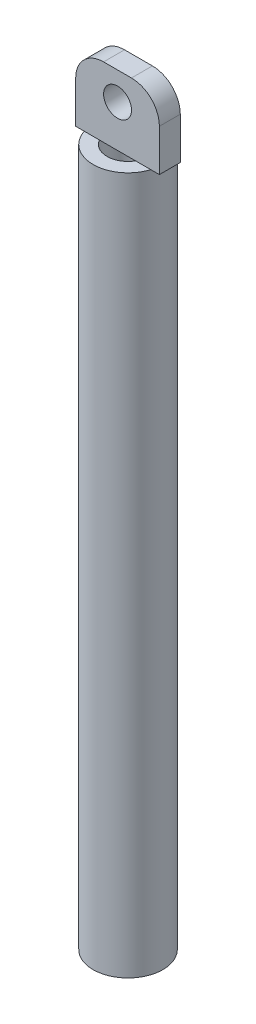
ISO-10303-21;
HEADER;
FILE_DESCRIPTION(('STEP AP214'),'2;1');
FILE_NAME('part.step','',(''),(''),'','','');
FILE_SCHEMA(('AUTOMOTIVE_DESIGN { 1 0 10303 214 1 1 1 1 }'));
ENDSEC;
DATA;
#1=APPLICATION_CONTEXT('core data for automotive mechanical design processes');
#2=APPLICATION_PROTOCOL_DEFINITION('international standard','automotive_design',2000,#1);
#3=PRODUCT_CONTEXT('',#1,'mechanical');
#4=PRODUCT('Part','Part','',(#3));
#5=PRODUCT_RELATED_PRODUCT_CATEGORY('part','',(#4));
#6=PRODUCT_DEFINITION_FORMATION('','',#4);
#7=PRODUCT_DEFINITION_CONTEXT('part definition',#1,'design');
#8=PRODUCT_DEFINITION('design','',#6,#7);
#9=PRODUCT_DEFINITION_SHAPE('','',#8);
#10=(LENGTH_UNIT() NAMED_UNIT(*) SI_UNIT(.MILLI.,.METRE.));
#11=(NAMED_UNIT(*) PLANE_ANGLE_UNIT() SI_UNIT($,.RADIAN.));
#12=(NAMED_UNIT(*) SI_UNIT($,.STERADIAN.) SOLID_ANGLE_UNIT());
#13=UNCERTAINTY_MEASURE_WITH_UNIT(LENGTH_MEASURE(1.E-05),#10,'distance_accuracy_value','');
#14=(GEOMETRIC_REPRESENTATION_CONTEXT(3) GLOBAL_UNCERTAINTY_ASSIGNED_CONTEXT((#13)) GLOBAL_UNIT_ASSIGNED_CONTEXT((#10,
#11,#12)) REPRESENTATION_CONTEXT('',''));
#15=CARTESIAN_POINT('',(0.,0.,0.));
#16=DIRECTION('',(0.,0.,1.));
#17=DIRECTION('',(1.,0.,0.));
#18=AXIS2_PLACEMENT_3D('',#15,#16,#17);
#19=CARTESIAN_POINT('',(0.,50.,0.));
#20=DIRECTION('',(0.,1.,0.));
#21=DIRECTION('',(0.,0.,1.));
#22=AXIS2_PLACEMENT_3D('',#19,#20,#21);
#23=PLANE('',#22);
#24=DIRECTION('',(1.,0.,0.));
#25=VECTOR('',#24,1.);
#26=CARTESIAN_POINT('',(-3.,50.,0.75));
#27=LINE('',#26,#25);
#28=CARTESIAN_POINT('',(-2.38484800354236,50.,0.75));
#29=VERTEX_POINT('',#28);
#30=CARTESIAN_POINT('',(-1.29903810567666,50.,0.75));
#31=VERTEX_POINT('',#30);
#32=EDGE_CURVE('E197',#29,#31,#27,.T.);
#33=ORIENTED_EDGE('',*,*,#32,.F.);
#34=CARTESIAN_POINT('',(0.,50.,0.));
#35=DIRECTION('',(0.,1.,0.));
#36=DIRECTION('',(0.,0.,1.));
#37=AXIS2_PLACEMENT_3D('',#34,#35,#36);
#38=CIRCLE('',#37,2.5);
#39=CARTESIAN_POINT('',(2.38484800354236,50.,0.75));
#40=VERTEX_POINT('',#39);
#41=EDGE_CURVE('E188',#29,#40,#38,.T.);
#42=ORIENTED_EDGE('',*,*,#41,.T.);
#43=CARTESIAN_POINT('',(1.29903810567666,50.,0.75));
#44=VERTEX_POINT('',#43);
#45=EDGE_CURVE('E168',#44,#40,#27,.T.);
#46=ORIENTED_EDGE('',*,*,#45,.F.);
#47=CARTESIAN_POINT('',(0.,50.,0.));
#48=DIRECTION('',(0.,1.,0.));
#49=DIRECTION('',(0.,0.,1.));
#50=AXIS2_PLACEMENT_3D('',#47,#48,#49);
#51=CIRCLE('',#50,1.5);
#52=EDGE_CURVE('E181',#31,#44,#51,.T.);
#53=ORIENTED_EDGE('',*,*,#52,.F.);
#54=EDGE_LOOP('',(#33,#42,#46,#53));
#55=FACE_BOUND('',#54,.T.);
#56=ADVANCED_FACE('F39',(#55),#23,.T.);
#57=DIRECTION('',(-1.,0.,0.));
#58=VECTOR('',#57,1.);
#59=CARTESIAN_POINT('',(-3.,50.,-0.75));
#60=LINE('',#59,#58);
#61=CARTESIAN_POINT('',(2.38484800354236,50.,-0.75));
#62=VERTEX_POINT('',#61);
#63=CARTESIAN_POINT('',(1.29903810567666,50.,-0.75));
#64=VERTEX_POINT('',#63);
#65=EDGE_CURVE('E241',#62,#64,#60,.T.);
#66=ORIENTED_EDGE('',*,*,#65,.F.);
#67=CARTESIAN_POINT('',(-2.38484800354236,50.,-0.75));
#68=VERTEX_POINT('',#67);
#69=EDGE_CURVE('E187',#62,#68,#38,.T.);
#70=ORIENTED_EDGE('',*,*,#69,.T.);
#71=CARTESIAN_POINT('',(-1.29903810567666,50.,-0.75));
#72=VERTEX_POINT('',#71);
#73=EDGE_CURVE('E140',#72,#68,#60,.T.);
#74=ORIENTED_EDGE('',*,*,#73,.F.);
#75=EDGE_CURVE('E180',#64,#72,#51,.T.);
#76=ORIENTED_EDGE('',*,*,#75,.F.);
#77=EDGE_LOOP('',(#66,#70,#74,#76));
#78=FACE_BOUND('',#77,.T.);
#79=ADVANCED_FACE('F266',(#78),#23,.T.);
#80=CARTESIAN_POINT('',(0.,0.,0.));
#81=DIRECTION('',(0.,1.,0.));
#82=DIRECTION('',(0.,0.,1.));
#83=AXIS2_PLACEMENT_3D('',#80,#81,#82);
#84=PLANE('',#83);
#85=CARTESIAN_POINT('',(0.,0.,0.));
#86=DIRECTION('',(0.,1.,0.));
#87=DIRECTION('',(0.,0.,1.));
#88=AXIS2_PLACEMENT_3D('',#85,#86,#87);
#89=CIRCLE('',#88,2.5);
#90=CARTESIAN_POINT('',(0.,0.,2.5));
#91=VERTEX_POINT('',#90);
#92=EDGE_CURVE('E179',#91,#91,#89,.T.);
#93=ORIENTED_EDGE('',*,*,#92,.F.);
#94=EDGE_LOOP('',(#93));
#95=FACE_BOUND('',#94,.T.);
#96=CARTESIAN_POINT('',(0.,0.,0.));
#97=DIRECTION('',(0.,1.,0.));
#98=DIRECTION('',(0.,0.,1.));
#99=AXIS2_PLACEMENT_3D('',#96,#97,#98);
#100=CIRCLE('',#99,1.5);
#101=CARTESIAN_POINT('',(0.,0.,1.5));
#102=VERTEX_POINT('',#101);
#103=EDGE_CURVE('E124',#102,#102,#100,.T.);
#104=ORIENTED_EDGE('',*,*,#103,.T.);
#105=EDGE_LOOP('',(#104));
#106=FACE_BOUND('',#105,.T.);
#107=ADVANCED_FACE('F281',(#95,#106),#84,.F.);
#108=CARTESIAN_POINT('',(0.,50.,0.));
#109=DIRECTION('',(0.,-1.,0.));
#110=DIRECTION('',(0.,0.,-1.));
#111=AXIS2_PLACEMENT_3D('',#108,#109,#110);
#112=CYLINDRICAL_SURFACE('',#111,2.5);
#113=EDGE_CURVE('E134',#40,#62,#38,.T.);
#114=ORIENTED_EDGE('',*,*,#113,.F.);
#115=ORIENTED_EDGE('',*,*,#41,.F.);
#116=EDGE_CURVE('E232',#68,#29,#38,.T.);
#117=ORIENTED_EDGE('',*,*,#116,.F.);
#118=ORIENTED_EDGE('',*,*,#69,.F.);
#119=EDGE_LOOP('',(#114,#115,#117,#118));
#120=FACE_BOUND('',#119,.T.);
#121=ORIENTED_EDGE('',*,*,#92,.T.);
#122=EDGE_LOOP('',(#121));
#123=FACE_BOUND('',#122,.T.);
#124=ADVANCED_FACE('F287',(#120,#123),#112,.T.);
#125=CARTESIAN_POINT('',(0.,50.,0.));
#126=DIRECTION('',(0.,-1.,0.));
#127=DIRECTION('',(0.,0.,-1.));
#128=AXIS2_PLACEMENT_3D('',#125,#126,#127);
#129=CYLINDRICAL_SURFACE('',#128,1.5);
#130=EDGE_CURVE('E176',#44,#64,#51,.T.);
#131=ORIENTED_EDGE('',*,*,#130,.T.);
#132=ORIENTED_EDGE('',*,*,#75,.T.);
#133=EDGE_CURVE('E254',#72,#31,#51,.T.);
#134=ORIENTED_EDGE('',*,*,#133,.T.);
#135=ORIENTED_EDGE('',*,*,#52,.T.);
#136=EDGE_LOOP('',(#131,#132,#134,#135));
#137=FACE_BOUND('',#136,.T.);
#138=ORIENTED_EDGE('',*,*,#103,.F.);
#139=EDGE_LOOP('',(#138));
#140=FACE_BOUND('',#139,.T.);
#141=ADVANCED_FACE('F249',(#137,#140),#129,.F.);
#142=CARTESIAN_POINT('',(0.,50.,0.));
#143=DIRECTION('',(0.,1.,0.));
#144=DIRECTION('',(0.,0.,1.));
#145=AXIS2_PLACEMENT_3D('',#142,#143,#144);
#146=PLANE('',#145);
#147=CARTESIAN_POINT('',(3.,50.,0.75));
#148=VERTEX_POINT('',#147);
#149=EDGE_CURVE('E161',#40,#148,#27,.T.);
#150=ORIENTED_EDGE('',*,*,#149,.F.);
#151=ORIENTED_EDGE('',*,*,#113,.T.);
#152=CARTESIAN_POINT('',(3.,50.,-0.75));
#153=VERTEX_POINT('',#152);
#154=EDGE_CURVE('E119',#153,#62,#60,.T.);
#155=ORIENTED_EDGE('',*,*,#154,.F.);
#156=DIRECTION('',(0.,0.,-1.));
#157=VECTOR('',#156,1.);
#158=CARTESIAN_POINT('',(3.,50.,-0.75));
#159=LINE('',#158,#157);
#160=EDGE_CURVE('E132',#148,#153,#159,.T.);
#161=ORIENTED_EDGE('',*,*,#160,.F.);
#162=EDGE_LOOP('',(#150,#151,#155,#161));
#163=FACE_BOUND('',#162,.T.);
#164=ADVANCED_FACE('F131',(#163),#146,.F.);
#165=CARTESIAN_POINT('',(-3.,50.,-0.75));
#166=VERTEX_POINT('',#165);
#167=EDGE_CURVE('E139',#68,#166,#60,.T.);
#168=ORIENTED_EDGE('',*,*,#167,.F.);
#169=ORIENTED_EDGE('',*,*,#116,.T.);
#170=CARTESIAN_POINT('',(-3.,50.,0.75));
#171=VERTEX_POINT('',#170);
#172=EDGE_CURVE('E162',#171,#29,#27,.T.);
#173=ORIENTED_EDGE('',*,*,#172,.F.);
#174=DIRECTION('',(0.,0.,1.));
#175=VECTOR('',#174,1.);
#176=CARTESIAN_POINT('',(-3.,50.,-0.75));
#177=LINE('',#176,#175);
#178=EDGE_CURVE('E136',#166,#171,#177,.T.);
#179=ORIENTED_EDGE('',*,*,#178,.F.);
#180=EDGE_LOOP('',(#168,#169,#173,#179));
#181=FACE_BOUND('',#180,.T.);
#182=ADVANCED_FACE('F230',(#181),#146,.F.);
#183=CARTESIAN_POINT('',(3.,55.,-0.75));
#184=DIRECTION('',(-1.,0.,0.));
#185=DIRECTION('',(0.,0.,1.));
#186=AXIS2_PLACEMENT_3D('',#183,#184,#185);
#187=PLANE('',#186);
#188=DIRECTION('',(0.,-1.,0.));
#189=VECTOR('',#188,1.);
#190=CARTESIAN_POINT('',(3.,55.,-0.75));
#191=LINE('',#190,#189);
#192=CARTESIAN_POINT('',(3.,53.,-0.75));
#193=VERTEX_POINT('',#192);
#194=EDGE_CURVE('E115',#193,#153,#191,.T.);
#195=ORIENTED_EDGE('',*,*,#194,.F.);
#196=DIRECTION('',(0.,0.,-1.));
#197=VECTOR('',#196,1.);
#198=CARTESIAN_POINT('',(3.,53.,0.75));
#199=LINE('',#198,#197);
#200=CARTESIAN_POINT('',(3.,53.,0.75));
#201=VERTEX_POINT('',#200);
#202=EDGE_CURVE('E11',#193,#201,#199,.F.);
#203=ORIENTED_EDGE('',*,*,#202,.T.);
#204=DIRECTION('',(0.,-1.,0.));
#205=VECTOR('',#204,1.);
#206=CARTESIAN_POINT('',(3.,55.,0.75));
#207=LINE('',#206,#205);
#208=EDGE_CURVE('E143',#201,#148,#207,.T.);
#209=ORIENTED_EDGE('',*,*,#208,.T.);
#210=ORIENTED_EDGE('',*,*,#160,.T.);
#211=EDGE_LOOP('',(#195,#203,#209,#210));
#212=FACE_BOUND('',#211,.T.);
#213=ADVANCED_FACE('F141',(#212),#187,.F.);
#214=CARTESIAN_POINT('',(-3.,55.,-0.75));
#215=DIRECTION('',(0.,0.,1.));
#216=DIRECTION('',(1.,0.,0.));
#217=AXIS2_PLACEMENT_3D('',#214,#215,#216);
#218=PLANE('',#217);
#219=CARTESIAN_POINT('',(0.,53.,-0.75));
#220=DIRECTION('',(0.,0.,-1.));
#221=DIRECTION('',(-1.,0.,0.));
#222=AXIS2_PLACEMENT_3D('',#219,#220,#221);
#223=CIRCLE('',#222,1.);
#224=CARTESIAN_POINT('',(-1.,53.,-0.75));
#225=VERTEX_POINT('',#224);
#226=EDGE_CURVE('E152',#225,#225,#223,.T.);
#227=ORIENTED_EDGE('',*,*,#226,.F.);
#228=EDGE_LOOP('',(#227));
#229=FACE_BOUND('',#228,.T.);
#230=DIRECTION('',(0.,-1.,0.));
#231=VECTOR('',#230,1.);
#232=CARTESIAN_POINT('',(-3.,55.,-0.75));
#233=LINE('',#232,#231);
#234=CARTESIAN_POINT('',(-3.,53.,-0.75));
#235=VERTEX_POINT('',#234);
#236=EDGE_CURVE('E125',#235,#166,#233,.T.);
#237=ORIENTED_EDGE('',*,*,#236,.F.);
#238=CARTESIAN_POINT('',(-1.,53.,-0.75));
#239=DIRECTION('',(0.,0.,1.));
#240=DIRECTION('',(1.,0.,0.));
#241=AXIS2_PLACEMENT_3D('',#238,#239,#240);
#242=CIRCLE('',#241,2.);
#243=CARTESIAN_POINT('',(-1.,55.,-0.75));
#244=VERTEX_POINT('',#243);
#245=EDGE_CURVE('E48',#235,#244,#242,.F.);
#246=ORIENTED_EDGE('',*,*,#245,.T.);
#247=DIRECTION('',(-1.,0.,0.));
#248=VECTOR('',#247,1.);
#249=CARTESIAN_POINT('',(-3.,55.,-0.75));
#250=LINE('',#249,#248);
#251=CARTESIAN_POINT('',(1.,55.,-0.75));
#252=VERTEX_POINT('',#251);
#253=EDGE_CURVE('E166',#252,#244,#250,.T.);
#254=ORIENTED_EDGE('',*,*,#253,.F.);
#255=CARTESIAN_POINT('',(1.,53.,-0.75));
#256=DIRECTION('',(0.,0.,1.));
#257=DIRECTION('',(1.,0.,0.));
#258=AXIS2_PLACEMENT_3D('',#255,#256,#257);
#259=CIRCLE('',#258,2.);
#260=EDGE_CURVE('E55',#252,#193,#259,.F.);
#261=ORIENTED_EDGE('',*,*,#260,.T.);
#262=ORIENTED_EDGE('',*,*,#194,.T.);
#263=ORIENTED_EDGE('',*,*,#154,.T.);
#264=ORIENTED_EDGE('',*,*,#65,.T.);
#265=EDGE_CURVE('E137',#64,#72,#60,.T.);
#266=ORIENTED_EDGE('',*,*,#265,.T.);
#267=ORIENTED_EDGE('',*,*,#73,.T.);
#268=ORIENTED_EDGE('',*,*,#167,.T.);
#269=EDGE_LOOP('',(#237,#246,#254,#261,#262,#263,#264,#266,#267,#268));
#270=FACE_BOUND('',#269,.T.);
#271=ADVANCED_FACE('F117',(#229,#270),#218,.F.);
#272=CARTESIAN_POINT('',(-3.,55.,-0.75));
#273=DIRECTION('',(1.,0.,0.));
#274=DIRECTION('',(0.,0.,-1.));
#275=AXIS2_PLACEMENT_3D('',#272,#273,#274);
#276=PLANE('',#275);
#277=DIRECTION('',(0.,-1.,0.));
#278=VECTOR('',#277,1.);
#279=CARTESIAN_POINT('',(-3.,55.,0.75));
#280=LINE('',#279,#278);
#281=CARTESIAN_POINT('',(-3.,53.,0.75));
#282=VERTEX_POINT('',#281);
#283=EDGE_CURVE('E171',#282,#171,#280,.T.);
#284=ORIENTED_EDGE('',*,*,#283,.F.);
#285=DIRECTION('',(0.,0.,1.));
#286=VECTOR('',#285,1.);
#287=CARTESIAN_POINT('',(-3.,53.,-0.75));
#288=LINE('',#287,#286);
#289=EDGE_CURVE('E63',#282,#235,#288,.F.);
#290=ORIENTED_EDGE('',*,*,#289,.T.);
#291=ORIENTED_EDGE('',*,*,#236,.T.);
#292=ORIENTED_EDGE('',*,*,#178,.T.);
#293=EDGE_LOOP('',(#284,#290,#291,#292));
#294=FACE_BOUND('',#293,.T.);
#295=ADVANCED_FACE('F224',(#294),#276,.F.);
#296=CARTESIAN_POINT('',(-3.,55.,0.75));
#297=DIRECTION('',(0.,0.,-1.));
#298=DIRECTION('',(-1.,0.,0.));
#299=AXIS2_PLACEMENT_3D('',#296,#297,#298);
#300=PLANE('',#299);
#301=CARTESIAN_POINT('',(0.,53.,0.75));
#302=DIRECTION('',(0.,0.,-1.));
#303=DIRECTION('',(-1.,0.,0.));
#304=AXIS2_PLACEMENT_3D('',#301,#302,#303);
#305=CIRCLE('',#304,1.);
#306=CARTESIAN_POINT('',(-1.,53.,0.75));
#307=VERTEX_POINT('',#306);
#308=EDGE_CURVE('E146',#307,#307,#305,.T.);
#309=ORIENTED_EDGE('',*,*,#308,.T.);
#310=EDGE_LOOP('',(#309));
#311=FACE_BOUND('',#310,.T.);
#312=DIRECTION('',(1.,0.,0.));
#313=VECTOR('',#312,1.);
#314=CARTESIAN_POINT('',(-3.,55.,0.75));
#315=LINE('',#314,#313);
#316=CARTESIAN_POINT('',(-1.,55.,0.75));
#317=VERTEX_POINT('',#316);
#318=CARTESIAN_POINT('',(1.,55.,0.75));
#319=VERTEX_POINT('',#318);
#320=EDGE_CURVE('E155',#317,#319,#315,.T.);
#321=ORIENTED_EDGE('',*,*,#320,.F.);
#322=CARTESIAN_POINT('',(-1.,53.,0.75));
#323=DIRECTION('',(0.,0.,-1.));
#324=DIRECTION('',(-1.,0.,0.));
#325=AXIS2_PLACEMENT_3D('',#322,#323,#324);
#326=CIRCLE('',#325,2.);
#327=EDGE_CURVE('E204',#317,#282,#326,.F.);
#328=ORIENTED_EDGE('',*,*,#327,.T.);
#329=ORIENTED_EDGE('',*,*,#283,.T.);
#330=ORIENTED_EDGE('',*,*,#172,.T.);
#331=ORIENTED_EDGE('',*,*,#32,.T.);
#332=EDGE_CURVE('E167',#31,#44,#27,.T.);
#333=ORIENTED_EDGE('',*,*,#332,.T.);
#334=ORIENTED_EDGE('',*,*,#45,.T.);
#335=ORIENTED_EDGE('',*,*,#149,.T.);
#336=ORIENTED_EDGE('',*,*,#208,.F.);
#337=CARTESIAN_POINT('',(1.,53.,0.75));
#338=DIRECTION('',(0.,0.,-1.));
#339=DIRECTION('',(-1.,0.,0.));
#340=AXIS2_PLACEMENT_3D('',#337,#338,#339);
#341=CIRCLE('',#340,2.);
#342=EDGE_CURVE('E201',#201,#319,#341,.F.);
#343=ORIENTED_EDGE('',*,*,#342,.T.);
#344=EDGE_LOOP('',(#321,#328,#329,#330,#331,#333,#334,#335,#336,#343));
#345=FACE_BOUND('',#344,.T.);
#346=ADVANCED_FACE('F223',(#311,#345),#300,.F.);
#347=CARTESIAN_POINT('',(0.,55.,0.));
#348=DIRECTION('',(0.,1.,0.));
#349=DIRECTION('',(0.,0.,1.));
#350=AXIS2_PLACEMENT_3D('',#347,#348,#349);
#351=PLANE('',#350);
#352=ORIENTED_EDGE('',*,*,#253,.T.);
#353=DIRECTION('',(0.,0.,1.));
#354=VECTOR('',#353,1.);
#355=CARTESIAN_POINT('',(-1.,55.,0.75));
#356=LINE('',#355,#354);
#357=EDGE_CURVE('E196',#244,#317,#356,.T.);
#358=ORIENTED_EDGE('',*,*,#357,.T.);
#359=ORIENTED_EDGE('',*,*,#320,.T.);
#360=DIRECTION('',(0.,0.,-1.));
#361=VECTOR('',#360,1.);
#362=CARTESIAN_POINT('',(1.,55.,-0.75));
#363=LINE('',#362,#361);
#364=EDGE_CURVE('E192',#319,#252,#363,.T.);
#365=ORIENTED_EDGE('',*,*,#364,.T.);
#366=EDGE_LOOP('',(#352,#358,#359,#365));
#367=FACE_BOUND('',#366,.T.);
#368=ADVANCED_FACE('F216',(#367),#351,.T.);
#369=ORIENTED_EDGE('',*,*,#130,.F.);
#370=ORIENTED_EDGE('',*,*,#332,.F.);
#371=ORIENTED_EDGE('',*,*,#133,.F.);
#372=ORIENTED_EDGE('',*,*,#265,.F.);
#373=EDGE_LOOP('',(#369,#370,#371,#372));
#374=FACE_BOUND('',#373,.T.);
#375=ADVANCED_FACE('F258',(#374),#146,.F.);
#376=CARTESIAN_POINT('',(0.,53.,2.5));
#377=DIRECTION('',(0.,0.,-1.));
#378=DIRECTION('',(-1.,0.,0.));
#379=AXIS2_PLACEMENT_3D('',#376,#377,#378);
#380=CYLINDRICAL_SURFACE('',#379,1.);
#381=ORIENTED_EDGE('',*,*,#226,.T.);
#382=EDGE_LOOP('',(#381));
#383=FACE_BOUND('',#382,.T.);
#384=ORIENTED_EDGE('',*,*,#308,.F.);
#385=EDGE_LOOP('',(#384));
#386=FACE_BOUND('',#385,.T.);
#387=ADVANCED_FACE('F275',(#383,#386),#380,.F.);
#388=CARTESIAN_POINT('',(-1.,53.,0.));
#389=DIRECTION('',(0.,0.,-1.));
#390=DIRECTION('',(-1.,0.,0.));
#391=AXIS2_PLACEMENT_3D('',#388,#389,#390);
#392=CYLINDRICAL_SURFACE('',#391,2.);
#393=ORIENTED_EDGE('',*,*,#245,.F.);
#394=ORIENTED_EDGE('',*,*,#289,.F.);
#395=ORIENTED_EDGE('',*,*,#327,.F.);
#396=ORIENTED_EDGE('',*,*,#357,.F.);
#397=EDGE_LOOP('',(#393,#394,#395,#396));
#398=FACE_BOUND('',#397,.T.);
#399=ADVANCED_FACE('F221',(#398),#392,.T.);
#400=CARTESIAN_POINT('',(1.,53.,0.));
#401=DIRECTION('',(0.,0.,1.));
#402=DIRECTION('',(1.,0.,0.));
#403=AXIS2_PLACEMENT_3D('',#400,#401,#402);
#404=CYLINDRICAL_SURFACE('',#403,2.);
#405=ORIENTED_EDGE('',*,*,#342,.F.);
#406=ORIENTED_EDGE('',*,*,#202,.F.);
#407=ORIENTED_EDGE('',*,*,#260,.F.);
#408=ORIENTED_EDGE('',*,*,#364,.F.);
#409=EDGE_LOOP('',(#405,#406,#407,#408));
#410=FACE_BOUND('',#409,.T.);
#411=ADVANCED_FACE('F41',(#410),#404,.T.);
#412=CLOSED_SHELL('',(#56,#79,#107,#124,#141,#164,#182,#213,#271,#295,#346,#368,#375,#387,#399,#411));
#413=MANIFOLD_SOLID_BREP('B2',#412);
#414=ADVANCED_BREP_SHAPE_REPRESENTATION('',(#18,#413),#14);
#415=SHAPE_DEFINITION_REPRESENTATION(#9,#414);
ENDSEC;
END-ISO-10303-21;
